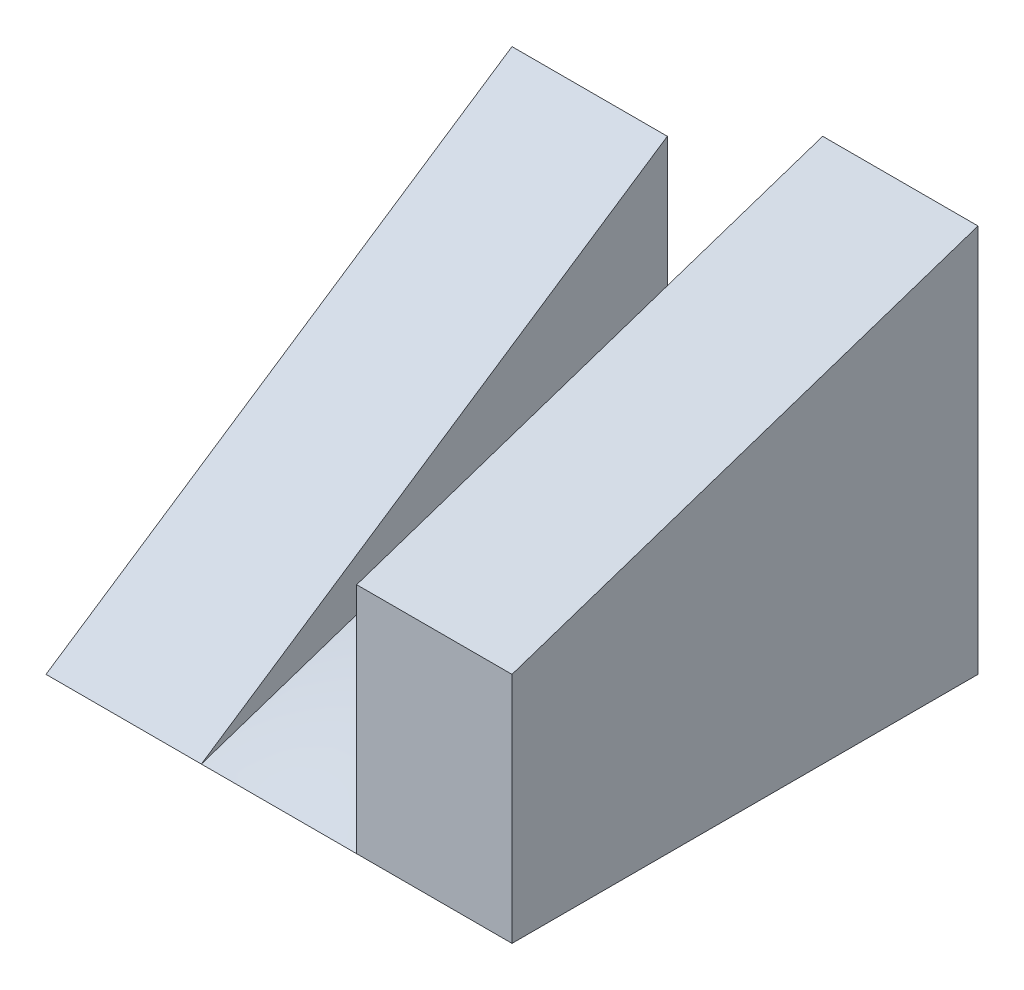
ISO-10303-21;
HEADER;
FILE_DESCRIPTION(('STEP AP214'),'2;1');
FILE_NAME('part.step','',(''),(''),'','','');
FILE_SCHEMA(('AUTOMOTIVE_DESIGN { 1 0 10303 214 1 1 1 1 }'));
ENDSEC;
DATA;
#1=APPLICATION_CONTEXT('core data for automotive mechanical design processes');
#2=APPLICATION_PROTOCOL_DEFINITION('international standard','automotive_design',2000,#1);
#3=PRODUCT_CONTEXT('',#1,'mechanical');
#4=PRODUCT('Part','Part','',(#3));
#5=PRODUCT_RELATED_PRODUCT_CATEGORY('part','',(#4));
#6=PRODUCT_DEFINITION_FORMATION('','',#4);
#7=PRODUCT_DEFINITION_CONTEXT('part definition',#1,'design');
#8=PRODUCT_DEFINITION('design','',#6,#7);
#9=PRODUCT_DEFINITION_SHAPE('','',#8);
#10=(LENGTH_UNIT() NAMED_UNIT(*) SI_UNIT(.MILLI.,.METRE.));
#11=(NAMED_UNIT(*) PLANE_ANGLE_UNIT() SI_UNIT($,.RADIAN.));
#12=(NAMED_UNIT(*) SI_UNIT($,.STERADIAN.) SOLID_ANGLE_UNIT());
#13=UNCERTAINTY_MEASURE_WITH_UNIT(LENGTH_MEASURE(1.E-05),#10,'distance_accuracy_value','');
#14=(GEOMETRIC_REPRESENTATION_CONTEXT(3) GLOBAL_UNCERTAINTY_ASSIGNED_CONTEXT((#13)) GLOBAL_UNIT_ASSIGNED_CONTEXT((#10,
#11,#12)) REPRESENTATION_CONTEXT('',''));
#15=CARTESIAN_POINT('',(0.,0.,0.));
#16=DIRECTION('',(0.,0.,1.));
#17=DIRECTION('',(1.,0.,0.));
#18=AXIS2_PLACEMENT_3D('',#15,#16,#17);
#19=CARTESIAN_POINT('',(-3.,5.,3.));
#20=DIRECTION('',(0.,0.,-1.));
#21=DIRECTION('',(-1.,0.,0.));
#22=AXIS2_PLACEMENT_3D('',#19,#20,#21);
#23=PLANE('',#22);
#24=DIRECTION('',(0.,1.,0.));
#25=VECTOR('',#24,1.);
#26=CARTESIAN_POINT('',(1.,0.,3.));
#27=LINE('',#26,#25);
#28=CARTESIAN_POINT('',(0.999824030636259,4.13135973588155E-05,3.00002409959846));
#29=VERTEX_POINT('',#28);
#30=CARTESIAN_POINT('',(1.,3.,3.));
#31=VERTEX_POINT('',#30);
#32=EDGE_CURVE('E283',#29,#31,#27,.T.);
#33=ORIENTED_EDGE('',*,*,#32,.F.);
#34=DIRECTION('',(1.,0.,0.));
#35=VECTOR('',#34,1.);
#36=CARTESIAN_POINT('',(-3.,0.,3.));
#37=LINE('',#36,#35);
#38=CARTESIAN_POINT('',(3.,0.,3.));
#39=VERTEX_POINT('',#38);
#40=EDGE_CURVE('E60',#29,#39,#37,.T.);
#41=ORIENTED_EDGE('',*,*,#40,.T.);
#42=DIRECTION('',(0.,-1.,0.));
#43=VECTOR('',#42,1.);
#44=CARTESIAN_POINT('',(3.,5.,3.));
#45=LINE('',#44,#43);
#46=CARTESIAN_POINT('',(3.,3.,3.));
#47=VERTEX_POINT('',#46);
#48=EDGE_CURVE('E224',#47,#39,#45,.T.);
#49=ORIENTED_EDGE('',*,*,#48,.F.);
#50=DIRECTION('',(1.,0.,0.));
#51=VECTOR('',#50,1.);
#52=CARTESIAN_POINT('',(1.,3.,3.));
#53=LINE('',#52,#51);
#54=EDGE_CURVE('E52',#31,#47,#53,.T.);
#55=ORIENTED_EDGE('',*,*,#54,.F.);
#56=EDGE_LOOP('',(#33,#41,#49,#55));
#57=FACE_BOUND('',#56,.T.);
#58=ADVANCED_FACE('F33',(#57),#23,.F.);
#59=CARTESIAN_POINT('',(3.,5.,3.));
#60=DIRECTION('',(-1.,0.,0.));
#61=DIRECTION('',(0.,0.,1.));
#62=AXIS2_PLACEMENT_3D('',#59,#60,#61);
#63=PLANE('',#62);
#64=DIRECTION('',(0.,-0.316227766016838,0.948683298050514));
#65=VECTOR('',#64,1.);
#66=CARTESIAN_POINT('',(3.,3.6,1.2));
#67=LINE('',#66,#65);
#68=CARTESIAN_POINT('',(3.,5.,-3.));
#69=VERTEX_POINT('',#68);
#70=EDGE_CURVE('E204',#69,#47,#67,.T.);
#71=ORIENTED_EDGE('',*,*,#70,.T.);
#72=ORIENTED_EDGE('',*,*,#48,.T.);
#73=DIRECTION('',(0.,0.,-1.));
#74=VECTOR('',#73,1.);
#75=CARTESIAN_POINT('',(3.,0.,3.));
#76=LINE('',#75,#74);
#77=CARTESIAN_POINT('',(3.,0.,-3.));
#78=VERTEX_POINT('',#77);
#79=EDGE_CURVE('E217',#39,#78,#76,.T.);
#80=ORIENTED_EDGE('',*,*,#79,.T.);
#81=DIRECTION('',(0.,-1.,0.));
#82=VECTOR('',#81,1.);
#83=CARTESIAN_POINT('',(3.,5.,-3.));
#84=LINE('',#83,#82);
#85=EDGE_CURVE('E11',#69,#78,#84,.T.);
#86=ORIENTED_EDGE('',*,*,#85,.F.);
#87=EDGE_LOOP('',(#71,#72,#80,#86));
#88=FACE_BOUND('',#87,.T.);
#89=ADVANCED_FACE('F35',(#88),#63,.F.);
#90=CARTESIAN_POINT('',(-3.,5.,-3.));
#91=DIRECTION('',(0.,0.,1.));
#92=DIRECTION('',(1.,0.,0.));
#93=AXIS2_PLACEMENT_3D('',#90,#91,#92);
#94=PLANE('',#93);
#95=DIRECTION('',(0.,1.,0.));
#96=VECTOR('',#95,1.);
#97=CARTESIAN_POINT('',(-1.,2.,-3.));
#98=LINE('',#97,#96);
#99=CARTESIAN_POINT('',(-1.00006712825124,2.00017900866996,-2.99994778913793));
#100=VERTEX_POINT('',#99);
#101=CARTESIAN_POINT('',(-1.,4.,-3.));
#102=VERTEX_POINT('',#101);
#103=EDGE_CURVE('E121',#100,#102,#98,.T.);
#104=ORIENTED_EDGE('',*,*,#103,.F.);
#105=CARTESIAN_POINT('',(1.00008040465894,4.99989279378809,-3.00006253695695));
#106=CARTESIAN_POINT('',(0.916681471413557,4.87495968025769,-3.00001716423681));
#107=CARTESIAN_POINT('',(0.833320769739728,4.75000106332428,-2.99999453486264));
#108=CARTESIAN_POINT('',(0.666624152781985,4.50005078030502,-2.99996855459121));
#109=CARTESIAN_POINT('',(0.583288240462293,4.37505911224178,-2.99996520545732));
#110=CARTESIAN_POINT('',(0.416604886567177,4.12508373093515,-2.99995157617292));
#111=CARTESIAN_POINT('',(0.333257445008821,4.00010001768038,-2.99994129603255));
#112=CARTESIAN_POINT('',(0.166570603586109,3.75012065297603,-2.9999273241891));
#113=CARTESIAN_POINT('',(0.0832312041251104,3.62512500125747,-2.99992363272594));
#114=CARTESIAN_POINT('',(-0.0834119988992825,3.37509015722996,-2.99994285925286));
#115=CARTESIAN_POINT('',(-0.166715797554653,3.25005096164875,-2.99996578016216));
#116=CARTESIAN_POINT('',(-0.333287984845794,2.99993263647601,-3.0000371648544));
#117=CARTESIAN_POINT('',(-0.416556369577917,2.87485350428883,-3.00008563095726));
#118=CARTESIAN_POINT('',(-0.583105791835689,2.62472787627937,-3.00016839418705));
#119=CARTESIAN_POINT('',(-0.66638682614205,2.49968137833055,-3.00020269322332));
#120=CARTESIAN_POINT('',(-0.833127721348826,2.24982666986964,-3.00013224457843));
#121=CARTESIAN_POINT('',(-0.91658742861983,2.12501835672964,-3.0000275883288));
#122=CARTESIAN_POINT('',(-1.00026851300495,2.00035801733993,-2.99979115655171));
#123=B_SPLINE_CURVE_WITH_KNOTS('',3,(#105,#106,#107,#108,#109,#110,#111,#112,#113,#114,#115,
#116,#117,#118,#119,#120,#121,#122),.UNSPECIFIED.,.F.,.F.,(4,2,2,2,2,2,2,2,4),(0.,
0.450636184331366,0.90131358331572,1.35199032209284,1.802683472149,2.25342606524434,
2.70420960010051,3.15493236138914,3.60535869741286),.UNSPECIFIED.);
#124=CARTESIAN_POINT('',(1.00009333081535,5.,-3.00016841346717));
#125=VERTEX_POINT('',#124);
#126=EDGE_CURVE('E106',#100,#125,#123,.F.);
#127=ORIENTED_EDGE('',*,*,#126,.T.);
#128=DIRECTION('',(-1.,0.,0.));
#129=VECTOR('',#128,1.);
#130=CARTESIAN_POINT('',(-3.,5.,-3.));
#131=LINE('',#130,#129);
#132=EDGE_CURVE('E222',#69,#125,#131,.T.);
#133=ORIENTED_EDGE('',*,*,#132,.F.);
#134=ORIENTED_EDGE('',*,*,#85,.T.);
#135=DIRECTION('',(-1.,0.,0.));
#136=VECTOR('',#135,1.);
#137=CARTESIAN_POINT('',(-3.,0.,-3.));
#138=LINE('',#137,#136);
#139=CARTESIAN_POINT('',(-3.,0.,-3.));
#140=VERTEX_POINT('',#139);
#141=EDGE_CURVE('E296',#78,#140,#138,.T.);
#142=ORIENTED_EDGE('',*,*,#141,.T.);
#143=DIRECTION('',(0.,-1.,0.));
#144=VECTOR('',#143,1.);
#145=CARTESIAN_POINT('',(-3.,5.,-3.));
#146=LINE('',#145,#144);
#147=CARTESIAN_POINT('',(-3.,4.,-3.));
#148=VERTEX_POINT('',#147);
#149=EDGE_CURVE('E44',#148,#140,#146,.T.);
#150=ORIENTED_EDGE('',*,*,#149,.F.);
#151=DIRECTION('',(-1.,0.,0.));
#152=VECTOR('',#151,1.);
#153=CARTESIAN_POINT('',(-1.,4.,-3.));
#154=LINE('',#153,#152);
#155=EDGE_CURVE('E135',#102,#148,#154,.T.);
#156=ORIENTED_EDGE('',*,*,#155,.F.);
#157=EDGE_LOOP('',(#104,#127,#133,#134,#142,#150,#156));
#158=FACE_BOUND('',#157,.T.);
#159=ADVANCED_FACE('F133',(#158),#94,.F.);
#160=CARTESIAN_POINT('',(-3.,5.,3.));
#161=DIRECTION('',(1.,0.,0.));
#162=DIRECTION('',(0.,0.,-1.));
#163=AXIS2_PLACEMENT_3D('',#160,#161,#162);
#164=PLANE('',#163);
#165=DIRECTION('',(0.,0.554700196225229,-0.832050294337844));
#166=VECTOR('',#165,1.);
#167=CARTESIAN_POINT('',(-3.,1.38461538461538,0.923076923076923));
#168=LINE('',#167,#166);
#169=CARTESIAN_POINT('',(-3.,0.,3.));
#170=VERTEX_POINT('',#169);
#171=EDGE_CURVE('E213',#170,#148,#168,.T.);
#172=ORIENTED_EDGE('',*,*,#171,.T.);
#173=ORIENTED_EDGE('',*,*,#149,.T.);
#174=DIRECTION('',(0.,0.,1.));
#175=VECTOR('',#174,1.);
#176=CARTESIAN_POINT('',(-3.,0.,3.));
#177=LINE('',#176,#175);
#178=EDGE_CURVE('E237',#140,#170,#177,.T.);
#179=ORIENTED_EDGE('',*,*,#178,.T.);
#180=EDGE_LOOP('',(#172,#173,#179));
#181=FACE_BOUND('',#180,.T.);
#182=ADVANCED_FACE('F254',(#181),#164,.F.);
#183=CARTESIAN_POINT('',(0.,0.,0.));
#184=DIRECTION('',(0.,-1.,0.));
#185=DIRECTION('',(0.,0.,-1.));
#186=AXIS2_PLACEMENT_3D('',#183,#184,#185);
#187=PLANE('',#186);
#188=CARTESIAN_POINT('',(-0.99966005221781,0.,2.99761836120237));
#189=CARTESIAN_POINT('',(-0.994413391388647,7.39493450077192E-06,2.99772192312364));
#190=CARTESIAN_POINT('',(-0.989166717952291,1.38336784967929E-05,2.9978249139539));
#191=CARTESIAN_POINT('',(-0.978671955766318,2.48245713873153E-05,2.99802979510755));
#192=CARTESIAN_POINT('',(-0.973423867010337,2.93762195405619E-05,2.99813168513186));
#193=CARTESIAN_POINT('',(-0.962926291354405,3.66157587503028E-05,2.998334377995));
#194=CARTESIAN_POINT('',(-0.95767680444848,3.93031610632141E-05,2.99843518054192));
#195=CARTESIAN_POINT('',(-0.947176449815908,4.28373082463135E-05,2.9986357119251));
#196=CARTESIAN_POINT('',(-0.941925582083661,4.36835763520727E-05,2.9987354404766));
#197=CARTESIAN_POINT('',(-0.931422483280792,4.35587510553707E-05,2.99893383745806));
#198=CARTESIAN_POINT('',(-0.926170252204932,4.25871928254071E-05,2.99903250561037));
#199=CARTESIAN_POINT('',(-0.915664444346009,3.88502163398873E-05,2.99922879550255));
#200=CARTESIAN_POINT('',(-0.910410867558054,3.6084345147583E-05,2.99932641697188));
#201=CARTESIAN_POINT('',(-0.899902386052358,2.8782426759671E-05,2.99952062731349));
#202=CARTESIAN_POINT('',(-0.894647481330055,2.42459384598732E-05,2.9996172159223));
#203=CARTESIAN_POINT('',(-0.88413636186152,1.34266840254119E-05,2.9998093744838));
#204=CARTESIAN_POINT('',(-0.878880147111041,7.14348856272311E-06,2.99990494418006));
#205=CARTESIAN_POINT('',(-0.873623924249039,0.,2.99999999999957));
#206=B_SPLINE_CURVE_WITH_KNOTS('',3,(#188,#189,#190,#191,#192,#193,#194,#195,#196,#197,#198,
#199,#200,#201,#202,#203,#204,#205),.UNSPECIFIED.,.F.,.F.,(4,2,2,2,2,2,2,2,4),(0.,
0.0157430639391097,0.0314903026338326,0.0472416681749146,0.0629971120701782,0.078756585263719,
0.0945200381551383,0.110287420618813,0.126058682023187),.UNSPECIFIED.);
#207=CARTESIAN_POINT('',(-0.999864409209099,-0.000547928512003631,2.99983352783386));
#208=VERTEX_POINT('',#207);
#209=CARTESIAN_POINT('',(-0.873623921949169,4.88506219999715E-12,3.00000000000285));
#210=VERTEX_POINT('',#209);
#211=EDGE_CURVE('E129',#208,#210,#206,.T.);
#212=ORIENTED_EDGE('',*,*,#211,.F.);
#213=EDGE_CURVE('E225',#170,#208,#37,.T.);
#214=ORIENTED_EDGE('',*,*,#213,.F.);
#215=ORIENTED_EDGE('',*,*,#178,.F.);
#216=ORIENTED_EDGE('',*,*,#141,.F.);
#217=ORIENTED_EDGE('',*,*,#79,.F.);
#218=ORIENTED_EDGE('',*,*,#40,.F.);
#219=CARTESIAN_POINT('',(0.854459358038968,-1.23752191220211E-12,2.99999999999928));
#220=CARTESIAN_POINT('',(0.860510948104662,1.64043102172083E-05,3.00000956918096));
#221=CARTESIAN_POINT('',(0.866562536704966,3.32116700718492E-05,3.00001937347421));
#222=CARTESIAN_POINT('',(0.878665114773238,6.76253110746525E-05,3.00003944809813));
#223=CARTESIAN_POINT('',(0.884716104241507,8.52315133660036E-05,3.0000497183828));
#224=CARTESIAN_POINT('',(0.896817488479882,0.000121237137561934,3.00007072166358));
#225=CARTESIAN_POINT('',(0.902867883250298,0.000139636481755351,3.00008145461436));
#226=CARTESIAN_POINT('',(0.91496808328195,0.00017722141372636,3.00010337915801));
#227=CARTESIAN_POINT('',(0.921017888543504,0.000196406925151376,3.00011457070634));
#228=CARTESIAN_POINT('',(0.933116915505284,0.000235556280259936,3.00013740783015));
#229=CARTESIAN_POINT('',(0.939166137205834,0.000255520049124835,3.00014905336199));
#230=CARTESIAN_POINT('',(0.951264003759502,0.00029621694699992,3.00017279321909));
#231=CARTESIAN_POINT('',(0.95731264861295,0.00031695000290769,3.0001848875017));
#232=CARTESIAN_POINT('',(0.969409368957451,0.000359175554492246,3.00020951907346));
#233=CARTESIAN_POINT('',(0.975457444448839,0.000380667978948464,3.00022205632106));
#234=CARTESIAN_POINT('',(0.987553034335307,0.000424401024455582,3.00024756726427));
#235=CARTESIAN_POINT('',(0.993600548730722,0.000446641576361352,3.00026054091955));
#236=CARTESIAN_POINT('',(0.999648061272518,0.000469251636642033,3.00027373012138));
#237=B_SPLINE_CURVE_WITH_KNOTS('',3,(#219,#220,#221,#222,#223,#224,#225,#226,#227,#228,#229,
#230,#231,#232,#233,#234,#235,#236),.UNSPECIFIED.,.F.,.F.,(4,2,2,2,2,2,2,2,4),(0.,
0.0181548595763165,0.0363079308990821,0.054459227628873,0.0726087656632677,0.0907565631538053,
0.108902640522804,0.127047020480021,0.145189728039185),.UNSPECIFIED.);
#238=CARTESIAN_POINT('',(0.854459358038968,-6.18808601704338E-13,2.99999999999964));
#239=VERTEX_POINT('',#238);
#240=EDGE_CURVE('E137',#239,#29,#237,.T.);
#241=ORIENTED_EDGE('',*,*,#240,.F.);
#242=CARTESIAN_POINT('',(0.0167758947317785,0.,3.));
#243=CARTESIAN_POINT('',(0.0517247270618871,-6.34976817486126E-05,2.99996295968565));
#244=CARTESIAN_POINT('',(0.0866735665501903,-0.000124820548153332,2.99992718801358));
#245=CARTESIAN_POINT('',(0.156564200493103,-0.000238070490814582,2.99986112554702));
#246=CARTESIAN_POINT('',(0.191505994943655,-0.000289999463978399,2.99983083364601));
#247=CARTESIAN_POINT('',(0.261378876033,-0.000379431465494275,2.99977866497846));
#248=CARTESIAN_POINT('',(0.29630996266386,-0.000416938920397231,2.99975678562977));
#249=CARTESIAN_POINT('',(0.366158286249898,-0.0004733600216095,2.99972387332073));
#250=CARTESIAN_POINT('',(0.401075523196753,-0.000492281045340267,2.99971283605689));
#251=CARTESIAN_POINT('',(0.470893582932963,-0.000508082011510734,2.99970361882662));
#252=CARTESIAN_POINT('',(0.505794405718762,-0.000504972315775417,2.9997054328158));
#253=CARTESIAN_POINT('',(0.575577701112922,-0.000474135153714457,2.99972342116033));
#254=CARTESIAN_POINT('',(0.610460173728578,-0.000446420622001393,2.9997395879705));
#255=CARTESIAN_POINT('',(0.680205510521859,-0.000364625279901717,2.99978730192006));
#256=CARTESIAN_POINT('',(0.715068374722505,-0.000310559268457724,2.99981884042673));
#257=CARTESIAN_POINT('',(0.784773961728465,-0.000175556470201959,2.99989759205905));
#258=CARTESIAN_POINT('',(0.819616684574038,-9.46351715228141E-05,2.99994479614995));
#259=CARTESIAN_POINT('',(0.854459358038968,-1.23752191220211E-12,2.99999999999928));
#260=B_SPLINE_CURVE_WITH_KNOTS('',3,(#242,#243,#244,#245,#246,#247,#248,#249,#250,#251,#252,
#253,#254,#255,#256,#257,#258,#259),.UNSPECIFIED.,.F.,.F.,(4,2,2,2,2,2,2,2,4),(0.,
0.104846731786936,0.209672268200142,0.314465603655729,0.419217327176252,0.523919785535772,
0.628567235020396,0.733155982289064,0.837684515066076),.UNSPECIFIED.);
#261=CARTESIAN_POINT('',(0.0167758947317784,0.,3.));
#262=VERTEX_POINT('',#261);
#263=EDGE_CURVE('E193',#262,#239,#260,.T.);
#264=ORIENTED_EDGE('',*,*,#263,.F.);
#265=CARTESIAN_POINT('',(-0.873623921949169,9.76999480395337E-12,3.0000000000057));
#266=CARTESIAN_POINT('',(-0.836620807710282,0.000159306280936904,3.00009292866388));
#267=CARTESIAN_POINT('',(-0.799617529981154,0.000286777360656116,3.00016728679372));
#268=CARTESIAN_POINT('',(-0.725570056985859,0.000487217737069172,3.00028421034663));
#269=CARTESIAN_POINT('',(-0.688525861498262,0.000560126908769415,3.00032674069678));
#270=CARTESIAN_POINT('',(-0.614403253164014,0.000660347485232764,3.00038520269972));
#271=CARTESIAN_POINT('',(-0.57732484024793,0.000687616802585532,3.00040110980151));
#272=CARTESIAN_POINT('',(-0.503140523053651,0.000705542871290052,3.00041156667492));
#273=CARTESIAN_POINT('',(-0.466034618769145,0.000696172470101784,3.00040610060756));
#274=CARTESIAN_POINT('',(-0.391801985690747,0.000649718643488265,3.00037900254204));
#275=CARTESIAN_POINT('',(-0.354675256911673,0.000612619648273411,3.0003573614615));
#276=CARTESIAN_POINT('',(-0.280407478566596,0.000519385141444563,3.00030297466585));
#277=CARTESIAN_POINT('',(-0.243266429013696,0.000463242275098192,3.00027022466048));
#278=CARTESIAN_POINT('',(-0.168976255950056,0.000340297404854817,3.0001985068195));
#279=CARTESIAN_POINT('',(-0.131827132444716,0.000273493079368325,3.00015953762963));
#280=CARTESIAN_POINT('',(-0.0575267095117519,0.00013698314098243,3.00007990683224));
#281=CARTESIAN_POINT('',(-0.0203754100845383,6.72773578309738E-05,3.0000392451254));
#282=CARTESIAN_POINT('',(0.0167758947317785,0.,3.));
#283=B_SPLINE_CURVE_WITH_KNOTS('',3,(#265,#266,#267,#268,#269,#270,#271,#272,#273,#274,#275,
#276,#277,#278,#279,#280,#281,#282),.UNSPECIFIED.,.F.,.F.,(4,2,2,2,2,2,2,2,4),(0.,
0.111010674107115,0.222143498036362,0.333378748253464,0.444696447024192,0.556076698423779,
0.667500013881565,0.778947625548501,0.890401785995016),.UNSPECIFIED.);
#284=EDGE_CURVE('E200',#210,#262,#283,.T.);
#285=ORIENTED_EDGE('',*,*,#284,.F.);
#286=EDGE_LOOP('',(#212,#214,#215,#216,#217,#218,#241,#264,#285));
#287=FACE_BOUND('',#286,.T.);
#288=ADVANCED_FACE('F257',(#287),#187,.T.);
#289=CARTESIAN_POINT('',(-1.,1.38461538461538,0.923076923076923));
#290=DIRECTION('',(0.,0.832050294337844,0.554700196225229));
#291=DIRECTION('',(0.,-0.554700196225229,0.832050294337844));
#292=AXIS2_PLACEMENT_3D('',#289,#290,#291);
#293=PLANE('',#292);
#294=ORIENTED_EDGE('',*,*,#171,.F.);
#295=ORIENTED_EDGE('',*,*,#213,.T.);
#296=DIRECTION('',(0.,0.554700196225229,-0.832050294337844));
#297=VECTOR('',#296,1.);
#298=CARTESIAN_POINT('',(-1.,1.38461538461538,0.923076923076923));
#299=LINE('',#298,#297);
#300=EDGE_CURVE('E128',#208,#102,#299,.T.);
#301=ORIENTED_EDGE('',*,*,#300,.T.);
#302=ORIENTED_EDGE('',*,*,#155,.T.);
#303=EDGE_LOOP('',(#294,#295,#301,#302));
#304=FACE_BOUND('',#303,.T.);
#305=ADVANCED_FACE('F262',(#304),#293,.T.);
#306=CARTESIAN_POINT('',(1.,3.6,1.2));
#307=DIRECTION('',(0.,0.948683298050514,0.316227766016838));
#308=DIRECTION('',(0.,-0.316227766016838,0.948683298050514));
#309=AXIS2_PLACEMENT_3D('',#306,#307,#308);
#310=PLANE('',#309);
#311=ORIENTED_EDGE('',*,*,#70,.F.);
#312=ORIENTED_EDGE('',*,*,#132,.T.);
#313=DIRECTION('',(0.,-0.316227766016838,0.948683298050514));
#314=VECTOR('',#313,1.);
#315=CARTESIAN_POINT('',(1.,3.6,1.2));
#316=LINE('',#315,#314);
#317=EDGE_CURVE('E211',#125,#31,#316,.T.);
#318=ORIENTED_EDGE('',*,*,#317,.T.);
#319=ORIENTED_EDGE('',*,*,#54,.T.);
#320=EDGE_LOOP('',(#311,#312,#318,#319));
#321=FACE_BOUND('',#320,.T.);
#322=ADVANCED_FACE('F154',(#321),#310,.T.);
#323=CARTESIAN_POINT('',(1.01827779451585,5.06791141457015,-3.04899949431026));
#324=CARTESIAN_POINT('',(0.60116854593653,4.66385268322769,-3.31865504101672));
#325=CARTESIAN_POINT('',(0.201882188138067,4.23603009751064,-3.60217283610836));
#326=CARTESIAN_POINT('',(-0.180493914912575,3.78566050546311,-3.89884305155948));
#327=CARTESIAN_POINT('',(-0.538574643727358,3.30289708110108,-4.21440966919403));
#328=CARTESIAN_POINT('',(-0.872634215609062,2.78810544749497,-4.54865940888765));
#329=CARTESIAN_POINT('',(1.06511071210092,4.08312305250958,-1.78176923477501));
#330=CARTESIAN_POINT('',(0.614673162235973,3.7235020562147,-2.02550276937033));
#331=CARTESIAN_POINT('',(0.184629974140119,3.33668857756113,-2.2850985853416));
#332=CARTESIAN_POINT('',(-0.231121908577068,2.93082002506914,-2.5558098610519));
#333=CARTESIAN_POINT('',(-0.618382337795319,2.48696286791212,-2.8486811561502));
#334=CARTESIAN_POINT('',(-0.982961508532456,2.01286403278035,-3.15919343006707));
#335=CARTESIAN_POINT('',(1.12963082979618,3.07475175696851,-0.528295686436703));
#336=CARTESIAN_POINT('',(0.63479446874113,2.77432917559393,-0.737496812328567));
#337=CARTESIAN_POINT('',(0.15338911041744,2.45599859057715,-0.957144273678333));
#338=CARTESIAN_POINT('',(-0.301133337986019,2.10182412566695,-1.19770066496605));
#339=CARTESIAN_POINT('',(-0.738349978562853,1.72457525032081,-1.45171712900795));
#340=CARTESIAN_POINT('',(-1.14610400986949,1.30804289594765,-1.72864895581564));
#341=CARTESIAN_POINT('',(1.18753572194193,2.07520076216061,0.730323037329256));
#342=CARTESIAN_POINT('',(0.658872353998545,1.81988085663662,0.547431805683629));
#343=CARTESIAN_POINT('',(0.142629460732691,1.54800031820966,0.35488020484453));
#344=CARTESIAN_POINT('',(-0.382350305426347,1.28776894364007,0.169123949588989));
#345=CARTESIAN_POINT('',(-0.874850246637232,0.984231135806593,-0.0418943917373041));
#346=CARTESIAN_POINT('',(-1.36308162830905,0.675001915254324,-0.256232723816261));
#347=CARTESIAN_POINT('',(1.29018919530272,1.01598499239884,1.95413730903884));
#348=CARTESIAN_POINT('',(0.674885508564193,0.87618551193544,1.83863299201181));
#349=CARTESIAN_POINT('',(0.0673492488782875,0.726029462068336,1.71708734283266));
#350=CARTESIAN_POINT('',(-0.512897771450914,0.539487759725739,1.57431672970944));
#351=CARTESIAN_POINT('',(-1.11129308164382,0.377143777201308,1.44566145314686));
#352=CARTESIAN_POINT('',(-1.69516856451034,0.195440024908448,1.30571297755269));
#353=CARTESIAN_POINT('',(1.45238592239036,-0.122621782331827,3.13164016118321));
#354=CARTESIAN_POINT('',(0.705366878689596,-0.0868007868456855,3.11858112179341));
#355=CARTESIAN_POINT('',(-0.0366097472326483,-0.0577030150642406,3.10160020190924));
#356=CARTESIAN_POINT('',(-0.788971371655887,-0.0147585786148803,3.09269650308138));
#357=CARTESIAN_POINT('',(-1.51196919800335,-0.0109658729331097,3.06095429463903));
#358=CARTESIAN_POINT('',(-2.21808055587718,-0.0296884585495011,3.01607816627275));
#359=B_SPLINE_SURFACE_WITH_KNOTS('',5,5,((#323,#324,#325,#326,#327,#328),(#329,#330,#331,#332,
#333,#334),(#335,#336,#337,#338,#339,#340),(#341,#342,#343,#344,#345,#346),(#347,#348,#349,#350,
#351,#352),(#353,#354,#355,#356,#357,#358)),.UNSPECIFIED.,.F.,.F.,.F.,(6,6),(6,6),
(-4.37585835602243,3.5872850820274),(-1.37022814666712,1.70181190988294),.UNSPECIFIED.);
#360=CARTESIAN_POINT('',(0.999648061272518,0.000469251636641464,3.00027373012138));
#361=CARTESIAN_POINT('',(1.00007468077681,0.208270285132214,2.74989808354982));
#362=CARTESIAN_POINT('',(1.00023204963588,0.416386331308021,2.49978463996284));
#363=CARTESIAN_POINT('',(1.00028250018853,0.832970810865248,1.99976330429119));
#364=CARTESIAN_POINT('',(1.0001755270542,1.04143930838776,1.74985546560582));
#365=CARTESIAN_POINT('',(0.999971556781531,1.4583676782219,1.25002641778653));
#366=CARTESIAN_POINT('',(0.999874559791594,1.66682755035914,1.00010520850903));
#367=CARTESIAN_POINT('',(0.99979197708558,2.08360258552791,0.500171529629692));
#368=CARTESIAN_POINT('',(0.999806383625817,2.29191775761092,0.250159067578841));
#369=CARTESIAN_POINT('',(0.999908882661132,2.70845191164819,-0.2499256371943));
#370=CARTESIAN_POINT('',(0.999996971627968,2.9166708977306,-0.499997876480998));
#371=CARTESIAN_POINT('',(1.00013269133198,3.33316269551421,-1.00011074511753));
#372=CARTESIAN_POINT('',(1.0001803208112,3.54143550868762,-1.25015137324287));
#373=CARTESIAN_POINT('',(1.0001262117922,3.95817056900299,-1.75010478639838));
#374=CARTESIAN_POINT('',(1.00002446269091,4.16663282854243,-2.00001756109372));
#375=CARTESIAN_POINT('',(0.99991803931373,4.58342791728182,-2.4999186164397));
#376=CARTESIAN_POINT('',(0.999913357621271,4.79176075515413,-2.74990688986217));
#377=CARTESIAN_POINT('',(1.00008040465894,4.9998927937881,-3.00006253695695));
#378=B_SPLINE_CURVE_WITH_KNOTS('',3,(#360,#361,#362,#363,#364,#365,#366,#367,#368,#369,#370,
#371,#372,#373,#374,#375,#376,#377),.UNSPECIFIED.,.F.,.F.,(4,2,2,2,2,2,2,2,4),(0.,
0.976125837145426,1.95245415231348,2.92879698817019,3.90507195882397,4.8813001837762,
5.85755876019849,6.83388663607722,7.81013991390023),.UNSPECIFIED.);
#379=EDGE_CURVE('E114',#125,#29,#378,.F.);
#380=CARTESIAN_POINT('',(-1.00026851300495,2.00035801733993,-2.99979115655171));
#381=CARTESIAN_POINT('',(-1.00002021138044,1.91668048085627,-2.74994487708446));
#382=CARTESIAN_POINT('',(-0.999934712825157,1.83323626755152,-2.5000207302677));
#383=CARTESIAN_POINT('',(-0.999901934570958,1.66653213201508,-2.00006493087289));
#384=CARTESIAN_POINT('',(-0.999954677761143,1.58327224258679,-1.75003326734606));
#385=CARTESIAN_POINT('',(-1.00001095321897,1.41668371900601,-1.24999882497187));
#386=CARTESIAN_POINT('',(-1.00001448654185,1.33335508636593,-0.999996045620096));
#387=CARTESIAN_POINT('',(-0.999972959682737,1.16663177334903,-0.500024512674036));
#388=CARTESIAN_POINT('',(-0.999927901598796,1.0832370959792,-0.250055758076709));
#389=CARTESIAN_POINT('',(-0.999865354702509,0.91648462852338,0.249902809119622));
#390=CARTESIAN_POINT('',(-0.999847866756071,0.833126839678157,0.499892622133424));
#391=CARTESIAN_POINT('',(-0.999908352748132,0.666540067662519,0.999941926809083));
#392=CARTESIAN_POINT('',(-0.999986335911107,0.583311097716679,1.2500014228697));
#393=CARTESIAN_POINT('',(-1.00021533127744,0.416957321557289,1.75015684032037));
#394=CARTESIAN_POINT('',(-1.00036634389298,0.333832515934291,2.00025276190803));
#395=CARTESIAN_POINT('',(-1.00030892258386,0.167103618028305,2.50016510937129));
#396=CARTESIAN_POINT('',(-1.0001006429377,0.083499746816621,2.74998160914137));
#397=CARTESIAN_POINT('',(-0.999496822466612,-0.000670903377852337,2.99960863969625));
#398=B_SPLINE_CURVE_WITH_KNOTS('',3,(#380,#381,#382,#383,#384,#385,#386,#387,#388,#389,#390,
#391,#392,#393,#394,#395,#396,#397),.UNSPECIFIED.,.F.,.F.,(4,2,2,2,2,2,2,2,4),(0.,
0.790458930528862,1.58104874796731,2.37162161231224,3.16216034310192,3.95272390220702,
4.7433638520543,5.53400826427447,6.32431326180089),.UNSPECIFIED.);
#399=EDGE_CURVE('E110',#208,#100,#398,.F.);
#400=ORIENTED_EDGE('',*,*,#211,.T.);
#401=ORIENTED_EDGE('',*,*,#284,.T.);
#402=ORIENTED_EDGE('',*,*,#263,.T.);
#403=ORIENTED_EDGE('',*,*,#240,.T.);
#404=ORIENTED_EDGE('',*,*,#379,.F.);
#405=ORIENTED_EDGE('',*,*,#126,.F.);
#406=ORIENTED_EDGE('',*,*,#399,.F.);
#407=EDGE_LOOP('',(#400,#401,#402,#403,#404,#405,#406));
#408=FACE_BOUND('',#407,.T.);
#409=ADVANCED_FACE('F109',(#408),#359,.F.);
#410=CARTESIAN_POINT('',(1.,5.,-3.));
#411=DIRECTION('',(-1.,0.,0.));
#412=DIRECTION('',(0.,0.,1.));
#413=AXIS2_PLACEMENT_3D('',#410,#411,#412);
#414=PLANE('',#413);
#415=ORIENTED_EDGE('',*,*,#379,.T.);
#416=ORIENTED_EDGE('',*,*,#32,.T.);
#417=ORIENTED_EDGE('',*,*,#317,.F.);
#418=EDGE_LOOP('',(#415,#416,#417));
#419=FACE_BOUND('',#418,.T.);
#420=ADVANCED_FACE('F153',(#419),#414,.T.);
#421=CARTESIAN_POINT('',(-1.,0.,3.));
#422=DIRECTION('',(1.,0.,0.));
#423=DIRECTION('',(0.,0.,-1.));
#424=AXIS2_PLACEMENT_3D('',#421,#422,#423);
#425=PLANE('',#424);
#426=ORIENTED_EDGE('',*,*,#399,.T.);
#427=ORIENTED_EDGE('',*,*,#103,.T.);
#428=ORIENTED_EDGE('',*,*,#300,.F.);
#429=EDGE_LOOP('',(#426,#427,#428));
#430=FACE_BOUND('',#429,.T.);
#431=ADVANCED_FACE('F126',(#430),#425,.T.);
#432=CLOSED_SHELL('',(#58,#89,#159,#182,#288,#305,#322,#409,#420,#431));
#433=MANIFOLD_SOLID_BREP('B2',#432);
#434=ADVANCED_BREP_SHAPE_REPRESENTATION('',(#18,#433),#14);
#435=SHAPE_DEFINITION_REPRESENTATION(#9,#434);
ENDSEC;
END-ISO-10303-21;
